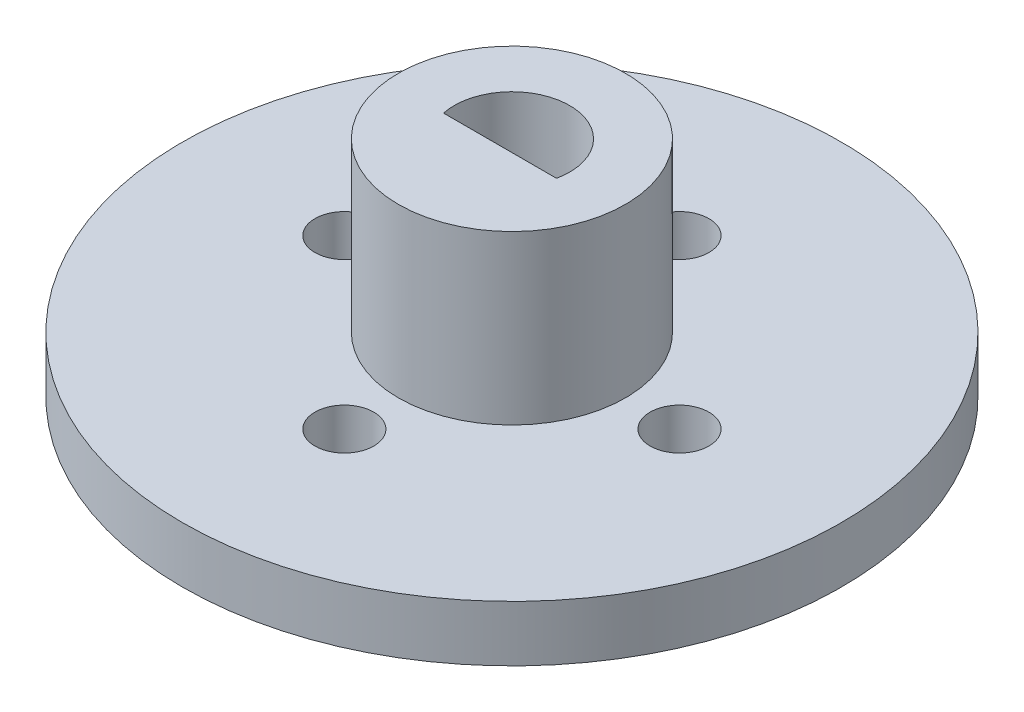
ISO-10303-21;
HEADER;
FILE_DESCRIPTION(('STEP AP214'),'2;1');
FILE_NAME('part.step','',(''),(''),'','','');
FILE_SCHEMA(('AUTOMOTIVE_DESIGN { 1 0 10303 214 1 1 1 1 }'));
ENDSEC;
DATA;
#1=APPLICATION_CONTEXT('core data for automotive mechanical design processes');
#2=APPLICATION_PROTOCOL_DEFINITION('international standard','automotive_design',2000,#1);
#3=PRODUCT_CONTEXT('',#1,'mechanical');
#4=PRODUCT('Part','Part','',(#3));
#5=PRODUCT_RELATED_PRODUCT_CATEGORY('part','',(#4));
#6=PRODUCT_DEFINITION_FORMATION('','',#4);
#7=PRODUCT_DEFINITION_CONTEXT('part definition',#1,'design');
#8=PRODUCT_DEFINITION('design','',#6,#7);
#9=PRODUCT_DEFINITION_SHAPE('','',#8);
#10=(LENGTH_UNIT() NAMED_UNIT(*) SI_UNIT(.MILLI.,.METRE.));
#11=(NAMED_UNIT(*) PLANE_ANGLE_UNIT() SI_UNIT($,.RADIAN.));
#12=(NAMED_UNIT(*) SI_UNIT($,.STERADIAN.) SOLID_ANGLE_UNIT());
#13=UNCERTAINTY_MEASURE_WITH_UNIT(LENGTH_MEASURE(1.E-05),#10,'distance_accuracy_value','');
#14=(GEOMETRIC_REPRESENTATION_CONTEXT(3) GLOBAL_UNCERTAINTY_ASSIGNED_CONTEXT((#13)) GLOBAL_UNIT_ASSIGNED_CONTEXT((#10,
#11,#12)) REPRESENTATION_CONTEXT('',''));
#15=CARTESIAN_POINT('',(0.,0.,0.));
#16=DIRECTION('',(0.,0.,1.));
#17=DIRECTION('',(1.,0.,0.));
#18=AXIS2_PLACEMENT_3D('',#15,#16,#17);
#19=CARTESIAN_POINT('',(0.,3.,0.));
#20=DIRECTION('',(0.,-1.,0.));
#21=DIRECTION('',(0.,0.,-1.));
#22=AXIS2_PLACEMENT_3D('',#19,#20,#21);
#23=CYLINDRICAL_SURFACE('',#22,17.7);
#24=CARTESIAN_POINT('',(0.,3.,0.));
#25=DIRECTION('',(0.,1.,0.));
#26=DIRECTION('',(0.,0.,1.));
#27=AXIS2_PLACEMENT_3D('',#24,#25,#26);
#28=CIRCLE('',#27,17.7);
#29=CARTESIAN_POINT('',(0.,3.,17.7));
#30=VERTEX_POINT('',#29);
#31=EDGE_CURVE('E12',#30,#30,#28,.T.);
#32=ORIENTED_EDGE('',*,*,#31,.F.);
#33=EDGE_LOOP('',(#32));
#34=FACE_BOUND('',#33,.T.);
#35=CARTESIAN_POINT('',(0.,0.,0.));
#36=DIRECTION('',(0.,1.,0.));
#37=DIRECTION('',(0.,0.,1.));
#38=AXIS2_PLACEMENT_3D('',#35,#36,#37);
#39=CIRCLE('',#38,17.7);
#40=CARTESIAN_POINT('',(0.,0.,17.7));
#41=VERTEX_POINT('',#40);
#42=EDGE_CURVE('E49',#41,#41,#39,.T.);
#43=ORIENTED_EDGE('',*,*,#42,.T.);
#44=EDGE_LOOP('',(#43));
#45=FACE_BOUND('',#44,.T.);
#46=ADVANCED_FACE('F40',(#34,#45),#23,.T.);
#47=CARTESIAN_POINT('',(0.,3.,0.));
#48=DIRECTION('',(0.,1.,0.));
#49=DIRECTION('',(0.,0.,1.));
#50=AXIS2_PLACEMENT_3D('',#47,#48,#49);
#51=PLANE('',#50);
#52=CARTESIAN_POINT('',(-9.,3.,0.));
#53=DIRECTION('',(0.,1.,0.));
#54=DIRECTION('',(0.,0.,1.));
#55=AXIS2_PLACEMENT_3D('',#52,#53,#54);
#56=CIRCLE('',#55,1.58);
#57=CARTESIAN_POINT('',(-9.,3.,1.58));
#58=VERTEX_POINT('',#57);
#59=EDGE_CURVE('E110',#58,#58,#56,.F.);
#60=ORIENTED_EDGE('',*,*,#59,.T.);
#61=EDGE_LOOP('',(#60));
#62=FACE_BOUND('',#61,.T.);
#63=CARTESIAN_POINT('',(9.,3.,0.));
#64=DIRECTION('',(0.,1.,0.));
#65=DIRECTION('',(0.,0.,1.));
#66=AXIS2_PLACEMENT_3D('',#63,#64,#65);
#67=CIRCLE('',#66,1.58);
#68=CARTESIAN_POINT('',(9.,3.,1.58));
#69=VERTEX_POINT('',#68);
#70=EDGE_CURVE('E106',#69,#69,#67,.F.);
#71=ORIENTED_EDGE('',*,*,#70,.T.);
#72=EDGE_LOOP('',(#71));
#73=FACE_BOUND('',#72,.T.);
#74=CARTESIAN_POINT('',(0.,3.,-9.));
#75=DIRECTION('',(0.,1.,0.));
#76=DIRECTION('',(0.,0.,1.));
#77=AXIS2_PLACEMENT_3D('',#74,#75,#76);
#78=CIRCLE('',#77,1.58);
#79=CARTESIAN_POINT('',(0.,3.,-7.42));
#80=VERTEX_POINT('',#79);
#81=EDGE_CURVE('E102',#80,#80,#78,.F.);
#82=ORIENTED_EDGE('',*,*,#81,.T.);
#83=EDGE_LOOP('',(#82));
#84=FACE_BOUND('',#83,.T.);
#85=CARTESIAN_POINT('',(0.,3.,9.));
#86=DIRECTION('',(0.,1.,0.));
#87=DIRECTION('',(0.,0.,1.));
#88=AXIS2_PLACEMENT_3D('',#85,#86,#87);
#89=CIRCLE('',#88,1.58);
#90=CARTESIAN_POINT('',(0.,3.,10.58));
#91=VERTEX_POINT('',#90);
#92=EDGE_CURVE('E87',#91,#91,#89,.F.);
#93=ORIENTED_EDGE('',*,*,#92,.T.);
#94=EDGE_LOOP('',(#93));
#95=FACE_BOUND('',#94,.T.);
#96=CARTESIAN_POINT('',(0.,3.,0.));
#97=DIRECTION('',(0.,1.,0.));
#98=DIRECTION('',(0.,0.,1.));
#99=AXIS2_PLACEMENT_3D('',#96,#97,#98);
#100=CIRCLE('',#99,6.1);
#101=CARTESIAN_POINT('',(0.,3.,6.1));
#102=VERTEX_POINT('',#101);
#103=EDGE_CURVE('E116',#102,#102,#100,.T.);
#104=ORIENTED_EDGE('',*,*,#103,.F.);
#105=EDGE_LOOP('',(#104));
#106=FACE_BOUND('',#105,.T.);
#107=ORIENTED_EDGE('',*,*,#31,.T.);
#108=EDGE_LOOP('',(#107));
#109=FACE_BOUND('',#108,.T.);
#110=ADVANCED_FACE('F143',(#62,#73,#84,#95,#106,#109),#51,.T.);
#111=CARTESIAN_POINT('',(0.,0.,0.));
#112=DIRECTION('',(0.,1.,0.));
#113=DIRECTION('',(0.,0.,1.));
#114=AXIS2_PLACEMENT_3D('',#111,#112,#113);
#115=PLANE('',#114);
#116=DIRECTION('',(1.,0.,0.));
#117=VECTOR('',#116,1.);
#118=CARTESIAN_POINT('',(-3.1,0.,0.64));
#119=LINE('',#118,#117);
#120=CARTESIAN_POINT('',(-3.03321611495126,0.,0.64));
#121=VERTEX_POINT('',#120);
#122=CARTESIAN_POINT('',(3.03321611495126,0.,0.64));
#123=VERTEX_POINT('',#122);
#124=EDGE_CURVE('E69',#121,#123,#119,.T.);
#125=ORIENTED_EDGE('',*,*,#124,.T.);
#126=CARTESIAN_POINT('',(0.,0.,0.));
#127=DIRECTION('',(0.,1.,0.));
#128=DIRECTION('',(0.,0.,1.));
#129=AXIS2_PLACEMENT_3D('',#126,#127,#128);
#130=CIRCLE('',#129,3.1);
#131=EDGE_CURVE('E97',#123,#121,#130,.T.);
#132=ORIENTED_EDGE('',*,*,#131,.T.);
#133=EDGE_LOOP('',(#125,#132));
#134=FACE_BOUND('',#133,.T.);
#135=CARTESIAN_POINT('',(-9.,0.,0.));
#136=DIRECTION('',(0.,1.,0.));
#137=DIRECTION('',(0.,0.,1.));
#138=AXIS2_PLACEMENT_3D('',#135,#136,#137);
#139=CIRCLE('',#138,1.58);
#140=CARTESIAN_POINT('',(-9.,0.,1.58));
#141=VERTEX_POINT('',#140);
#142=EDGE_CURVE('E107',#141,#141,#139,.F.);
#143=ORIENTED_EDGE('',*,*,#142,.F.);
#144=EDGE_LOOP('',(#143));
#145=FACE_BOUND('',#144,.T.);
#146=CARTESIAN_POINT('',(9.,0.,0.));
#147=DIRECTION('',(0.,1.,0.));
#148=DIRECTION('',(0.,0.,1.));
#149=AXIS2_PLACEMENT_3D('',#146,#147,#148);
#150=CIRCLE('',#149,1.58);
#151=CARTESIAN_POINT('',(9.,0.,1.58));
#152=VERTEX_POINT('',#151);
#153=EDGE_CURVE('E103',#152,#152,#150,.F.);
#154=ORIENTED_EDGE('',*,*,#153,.F.);
#155=EDGE_LOOP('',(#154));
#156=FACE_BOUND('',#155,.T.);
#157=CARTESIAN_POINT('',(0.,0.,-9.));
#158=DIRECTION('',(0.,1.,0.));
#159=DIRECTION('',(0.,0.,1.));
#160=AXIS2_PLACEMENT_3D('',#157,#158,#159);
#161=CIRCLE('',#160,1.58);
#162=CARTESIAN_POINT('',(0.,0.,-7.42));
#163=VERTEX_POINT('',#162);
#164=EDGE_CURVE('E93',#163,#163,#161,.F.);
#165=ORIENTED_EDGE('',*,*,#164,.F.);
#166=EDGE_LOOP('',(#165));
#167=FACE_BOUND('',#166,.T.);
#168=CARTESIAN_POINT('',(0.,0.,9.));
#169=DIRECTION('',(0.,1.,0.));
#170=DIRECTION('',(0.,0.,1.));
#171=AXIS2_PLACEMENT_3D('',#168,#169,#170);
#172=CIRCLE('',#171,1.58);
#173=CARTESIAN_POINT('',(0.,0.,10.58));
#174=VERTEX_POINT('',#173);
#175=EDGE_CURVE('E84',#174,#174,#172,.F.);
#176=ORIENTED_EDGE('',*,*,#175,.F.);
#177=EDGE_LOOP('',(#176));
#178=FACE_BOUND('',#177,.T.);
#179=ORIENTED_EDGE('',*,*,#42,.F.);
#180=EDGE_LOOP('',(#179));
#181=FACE_BOUND('',#180,.T.);
#182=ADVANCED_FACE('F136',(#134,#145,#156,#167,#178,#181),#115,.F.);
#183=CARTESIAN_POINT('',(0.,-1.2E-05,0.));
#184=DIRECTION('',(0.,1.,0.));
#185=DIRECTION('',(0.,0.,1.));
#186=AXIS2_PLACEMENT_3D('',#183,#184,#185);
#187=CYLINDRICAL_SURFACE('',#186,3.1);
#188=CARTESIAN_POINT('',(0.,12.,0.));
#189=DIRECTION('',(0.,1.,0.));
#190=DIRECTION('',(0.,0.,1.));
#191=AXIS2_PLACEMENT_3D('',#188,#189,#190);
#192=CIRCLE('',#191,3.1);
#193=CARTESIAN_POINT('',(3.03321611495126,12.,0.64));
#194=VERTEX_POINT('',#193);
#195=CARTESIAN_POINT('',(-3.03321611495126,12.,0.64));
#196=VERTEX_POINT('',#195);
#197=EDGE_CURVE('E43',#194,#196,#192,.T.);
#198=ORIENTED_EDGE('',*,*,#197,.T.);
#199=DIRECTION('',(0.,1.,0.));
#200=VECTOR('',#199,1.);
#201=CARTESIAN_POINT('',(-3.03321611495126,-1.2E-05,0.64));
#202=LINE('',#201,#200);
#203=EDGE_CURVE('E67',#196,#121,#202,.F.);
#204=ORIENTED_EDGE('',*,*,#203,.T.);
#205=ORIENTED_EDGE('',*,*,#131,.F.);
#206=DIRECTION('',(0.,1.,0.));
#207=VECTOR('',#206,1.);
#208=CARTESIAN_POINT('',(3.03321611495126,-1.2E-05,0.64));
#209=LINE('',#208,#207);
#210=EDGE_CURVE('E61',#123,#194,#209,.T.);
#211=ORIENTED_EDGE('',*,*,#210,.T.);
#212=EDGE_LOOP('',(#198,#204,#205,#211));
#213=FACE_BOUND('',#212,.T.);
#214=ADVANCED_FACE('F82',(#213),#187,.F.);
#215=CARTESIAN_POINT('',(0.,12.,0.));
#216=DIRECTION('',(0.,-1.,0.));
#217=DIRECTION('',(0.,0.,-1.));
#218=AXIS2_PLACEMENT_3D('',#215,#216,#217);
#219=CYLINDRICAL_SURFACE('',#218,6.1);
#220=CARTESIAN_POINT('',(0.,12.,0.));
#221=DIRECTION('',(0.,1.,0.));
#222=DIRECTION('',(0.,0.,1.));
#223=AXIS2_PLACEMENT_3D('',#220,#221,#222);
#224=CIRCLE('',#223,6.1);
#225=CARTESIAN_POINT('',(0.,12.,6.1));
#226=VERTEX_POINT('',#225);
#227=EDGE_CURVE('E124',#226,#226,#224,.T.);
#228=ORIENTED_EDGE('',*,*,#227,.F.);
#229=EDGE_LOOP('',(#228));
#230=FACE_BOUND('',#229,.T.);
#231=ORIENTED_EDGE('',*,*,#103,.T.);
#232=EDGE_LOOP('',(#231));
#233=FACE_BOUND('',#232,.T.);
#234=ADVANCED_FACE('F181',(#230,#233),#219,.T.);
#235=CARTESIAN_POINT('',(0.,12.,0.));
#236=DIRECTION('',(0.,1.,0.));
#237=DIRECTION('',(0.,0.,1.));
#238=AXIS2_PLACEMENT_3D('',#235,#236,#237);
#239=PLANE('',#238);
#240=ORIENTED_EDGE('',*,*,#197,.F.);
#241=DIRECTION('',(1.,0.,0.));
#242=VECTOR('',#241,1.);
#243=CARTESIAN_POINT('',(-3.1,12.,0.64));
#244=LINE('',#243,#242);
#245=EDGE_CURVE('E57',#196,#194,#244,.T.);
#246=ORIENTED_EDGE('',*,*,#245,.F.);
#247=EDGE_LOOP('',(#240,#246));
#248=FACE_BOUND('',#247,.T.);
#249=ORIENTED_EDGE('',*,*,#227,.T.);
#250=EDGE_LOOP('',(#249));
#251=FACE_BOUND('',#250,.T.);
#252=ADVANCED_FACE('F78',(#248,#251),#239,.T.);
#253=CARTESIAN_POINT('',(0.,12.,9.));
#254=DIRECTION('',(0.,-1.,0.));
#255=DIRECTION('',(0.,0.,-1.));
#256=AXIS2_PLACEMENT_3D('',#253,#254,#255);
#257=CYLINDRICAL_SURFACE('',#256,1.58);
#258=ORIENTED_EDGE('',*,*,#92,.F.);
#259=EDGE_LOOP('',(#258));
#260=FACE_BOUND('',#259,.T.);
#261=ORIENTED_EDGE('',*,*,#175,.T.);
#262=EDGE_LOOP('',(#261));
#263=FACE_BOUND('',#262,.T.);
#264=ADVANCED_FACE('F154',(#260,#263),#257,.F.);
#265=CARTESIAN_POINT('',(0.,12.,-9.));
#266=DIRECTION('',(0.,-1.,0.));
#267=DIRECTION('',(0.,0.,-1.));
#268=AXIS2_PLACEMENT_3D('',#265,#266,#267);
#269=CYLINDRICAL_SURFACE('',#268,1.58);
#270=ORIENTED_EDGE('',*,*,#81,.F.);
#271=EDGE_LOOP('',(#270));
#272=FACE_BOUND('',#271,.T.);
#273=ORIENTED_EDGE('',*,*,#164,.T.);
#274=EDGE_LOOP('',(#273));
#275=FACE_BOUND('',#274,.T.);
#276=ADVANCED_FACE('F151',(#272,#275),#269,.F.);
#277=CARTESIAN_POINT('',(9.,12.,0.));
#278=DIRECTION('',(0.,-1.,0.));
#279=DIRECTION('',(0.,0.,-1.));
#280=AXIS2_PLACEMENT_3D('',#277,#278,#279);
#281=CYLINDRICAL_SURFACE('',#280,1.58);
#282=ORIENTED_EDGE('',*,*,#70,.F.);
#283=EDGE_LOOP('',(#282));
#284=FACE_BOUND('',#283,.T.);
#285=ORIENTED_EDGE('',*,*,#153,.T.);
#286=EDGE_LOOP('',(#285));
#287=FACE_BOUND('',#286,.T.);
#288=ADVANCED_FACE('F153',(#284,#287),#281,.F.);
#289=CARTESIAN_POINT('',(-9.,12.,0.));
#290=DIRECTION('',(0.,-1.,0.));
#291=DIRECTION('',(0.,0.,-1.));
#292=AXIS2_PLACEMENT_3D('',#289,#290,#291);
#293=CYLINDRICAL_SURFACE('',#292,1.58);
#294=ORIENTED_EDGE('',*,*,#59,.F.);
#295=EDGE_LOOP('',(#294));
#296=FACE_BOUND('',#295,.T.);
#297=ORIENTED_EDGE('',*,*,#142,.T.);
#298=EDGE_LOOP('',(#297));
#299=FACE_BOUND('',#298,.T.);
#300=ADVANCED_FACE('F161',(#296,#299),#293,.F.);
#301=CARTESIAN_POINT('',(-3.1,18.6702023957298,0.64));
#302=DIRECTION('',(0.,0.,-1.));
#303=DIRECTION('',(-1.,0.,0.));
#304=AXIS2_PLACEMENT_3D('',#301,#302,#303);
#305=PLANE('',#304);
#306=ORIENTED_EDGE('',*,*,#203,.F.);
#307=ORIENTED_EDGE('',*,*,#245,.T.);
#308=ORIENTED_EDGE('',*,*,#210,.F.);
#309=ORIENTED_EDGE('',*,*,#124,.F.);
#310=EDGE_LOOP('',(#306,#307,#308,#309));
#311=FACE_BOUND('',#310,.T.);
#312=ADVANCED_FACE('F68',(#311),#305,.T.);
#313=CLOSED_SHELL('',(#46,#110,#182,#214,#234,#252,#264,#276,#288,#300,#312));
#314=MANIFOLD_SOLID_BREP('B2',#313);
#315=ADVANCED_BREP_SHAPE_REPRESENTATION('',(#18,#314),#14);
#316=SHAPE_DEFINITION_REPRESENTATION(#9,#315);
ENDSEC;
END-ISO-10303-21;
